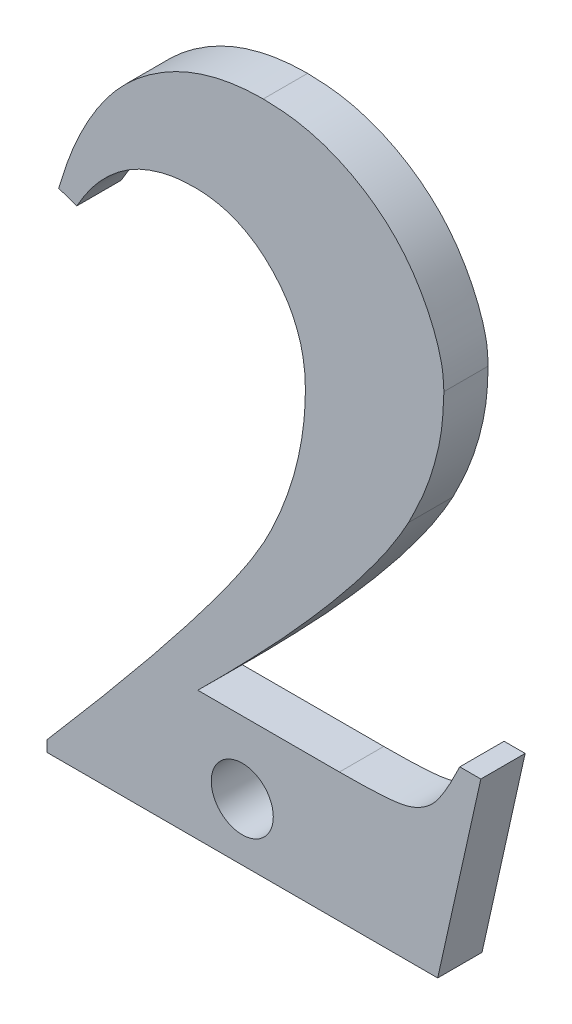
ISO-10303-21;
HEADER;
FILE_DESCRIPTION(('STEP AP214'),'2;1');
FILE_NAME('part.step','',(''),(''),'','','');
FILE_SCHEMA(('AUTOMOTIVE_DESIGN { 1 0 10303 214 1 1 1 1 }'));
ENDSEC;
DATA;
#1=APPLICATION_CONTEXT('core data for automotive mechanical design processes');
#2=APPLICATION_PROTOCOL_DEFINITION('international standard','automotive_design',2000,#1);
#3=PRODUCT_CONTEXT('',#1,'mechanical');
#4=PRODUCT('Part','Part','',(#3));
#5=PRODUCT_RELATED_PRODUCT_CATEGORY('part','',(#4));
#6=PRODUCT_DEFINITION_FORMATION('','',#4);
#7=PRODUCT_DEFINITION_CONTEXT('part definition',#1,'design');
#8=PRODUCT_DEFINITION('design','',#6,#7);
#9=PRODUCT_DEFINITION_SHAPE('','',#8);
#10=(LENGTH_UNIT() NAMED_UNIT(*) SI_UNIT(.MILLI.,.METRE.));
#11=(NAMED_UNIT(*) PLANE_ANGLE_UNIT() SI_UNIT($,.RADIAN.));
#12=(NAMED_UNIT(*) SI_UNIT($,.STERADIAN.) SOLID_ANGLE_UNIT());
#13=UNCERTAINTY_MEASURE_WITH_UNIT(LENGTH_MEASURE(1.E-05),#10,'distance_accuracy_value','');
#14=(GEOMETRIC_REPRESENTATION_CONTEXT(3) GLOBAL_UNCERTAINTY_ASSIGNED_CONTEXT((#13)) GLOBAL_UNIT_ASSIGNED_CONTEXT((#10,
#11,#12)) REPRESENTATION_CONTEXT('',''));
#15=CARTESIAN_POINT('',(0.,0.,0.));
#16=DIRECTION('',(0.,0.,1.));
#17=DIRECTION('',(1.,0.,0.));
#18=AXIS2_PLACEMENT_3D('',#15,#16,#17);
#19=CARTESIAN_POINT('',(32.1256973052124,19.955600964685,2.));
#20=DIRECTION('',(0.976135765287796,-0.217161156116854,0.));
#21=DIRECTION('',(0.217161156116854,0.976135765287796,0.));
#22=AXIS2_PLACEMENT_3D('',#19,#20,#21);
#23=PLANE('',#22);
#24=DIRECTION('',(-0.217161156116854,-0.976135765287796,0.));
#25=VECTOR('',#24,1.);
#26=CARTESIAN_POINT('',(32.1256973052124,19.955600964685,0.));
#27=LINE('',#26,#25);
#28=CARTESIAN_POINT('',(32.1256973052124,19.955600964685,0.));
#29=VERTEX_POINT('',#28);
#30=CARTESIAN_POINT('',(30.1790827218791,11.205600964685,0.));
#31=VERTEX_POINT('',#30);
#32=EDGE_CURVE('E288',#29,#31,#27,.T.);
#33=ORIENTED_EDGE('',*,*,#32,.F.);
#34=DIRECTION('',(0.,0.,-1.));
#35=VECTOR('',#34,1.);
#36=CARTESIAN_POINT('',(32.1256973052124,19.955600964685,2.));
#37=LINE('',#36,#35);
#38=CARTESIAN_POINT('',(32.1256973052124,19.955600964685,2.));
#39=VERTEX_POINT('',#38);
#40=EDGE_CURVE('E11',#39,#29,#37,.T.);
#41=ORIENTED_EDGE('',*,*,#40,.F.);
#42=DIRECTION('',(-0.217161156116854,-0.976135765287796,0.));
#43=VECTOR('',#42,1.);
#44=CARTESIAN_POINT('',(32.1256973052124,19.955600964685,2.));
#45=LINE('',#44,#43);
#46=CARTESIAN_POINT('',(30.1790827218791,11.205600964685,2.));
#47=VERTEX_POINT('',#46);
#48=EDGE_CURVE('E295',#39,#47,#45,.T.);
#49=ORIENTED_EDGE('',*,*,#48,.T.);
#50=DIRECTION('',(0.,0.,-1.));
#51=VECTOR('',#50,1.);
#52=CARTESIAN_POINT('',(30.1790827218791,11.205600964685,2.));
#53=LINE('',#52,#51);
#54=EDGE_CURVE('E40',#47,#31,#53,.T.);
#55=ORIENTED_EDGE('',*,*,#54,.T.);
#56=EDGE_LOOP('',(#33,#41,#49,#55));
#57=FACE_BOUND('',#56,.T.);
#58=ADVANCED_FACE('F37',(#57),#23,.T.);
#59=CARTESIAN_POINT('',(31.1751764718791,19.955600964685,2.));
#60=DIRECTION('',(0.,1.,0.));
#61=DIRECTION('',(0.,0.,1.));
#62=AXIS2_PLACEMENT_3D('',#59,#60,#61);
#63=PLANE('',#62);
#64=DIRECTION('',(1.,0.,0.));
#65=VECTOR('',#64,1.);
#66=CARTESIAN_POINT('',(31.1751764718791,19.955600964685,0.));
#67=LINE('',#66,#65);
#68=CARTESIAN_POINT('',(31.1751764718791,19.955600964685,0.));
#69=VERTEX_POINT('',#68);
#70=EDGE_CURVE('E294',#69,#29,#67,.T.);
#71=ORIENTED_EDGE('',*,*,#70,.F.);
#72=DIRECTION('',(0.,0.,-1.));
#73=VECTOR('',#72,1.);
#74=CARTESIAN_POINT('',(31.1751764718791,19.955600964685,2.));
#75=LINE('',#74,#73);
#76=CARTESIAN_POINT('',(31.1751764718791,19.955600964685,2.));
#77=VERTEX_POINT('',#76);
#78=EDGE_CURVE('E46',#77,#69,#75,.T.);
#79=ORIENTED_EDGE('',*,*,#78,.F.);
#80=DIRECTION('',(1.,0.,0.));
#81=VECTOR('',#80,1.);
#82=CARTESIAN_POINT('',(31.1751764718791,19.955600964685,2.));
#83=LINE('',#82,#81);
#84=EDGE_CURVE('E160',#77,#39,#83,.T.);
#85=ORIENTED_EDGE('',*,*,#84,.T.);
#86=ORIENTED_EDGE('',*,*,#40,.T.);
#87=EDGE_LOOP('',(#71,#79,#85,#86));
#88=FACE_BOUND('',#87,.T.);
#89=ADVANCED_FACE('F183',(#88),#63,.T.);
#90=CARTESIAN_POINT('',(25.7454889718791,17.0389342980183,2.));
#91=CARTESIAN_POINT('',(25.9343136454098,17.0374642110336,2.));
#92=CARTESIAN_POINT('',(26.292485047655,17.0346756818288,2.));
#93=CARTESIAN_POINT('',(26.804467081618,17.0533849821531,2.));
#94=CARTESIAN_POINT('',(27.2650009298902,17.0598931247864,2.));
#95=CARTESIAN_POINT('',(27.6726909838592,17.0899066015692,2.));
#96=CARTESIAN_POINT('',(28.0287995636569,17.1145824506281,2.));
#97=CARTESIAN_POINT('',(28.3338956544454,17.1427808252753,2.));
#98=CARTESIAN_POINT('',(28.5870447080286,17.1909813001313,2.));
#99=CARTESIAN_POINT('',(28.9670403916918,17.2719448112459,2.));
#100=CARTESIAN_POINT('',(29.4533257375363,17.4838455965586,2.));
#101=CARTESIAN_POINT('',(29.9244831407864,17.8446529890732,2.));
#102=CARTESIAN_POINT('',(30.2502710835867,18.2626609520851,2.));
#103=CARTESIAN_POINT('',(30.5314567461514,18.7068770562229,2.));
#104=CARTESIAN_POINT('',(30.8505597612063,19.2832156923998,2.));
#105=CARTESIAN_POINT('',(31.0603904840978,19.7178423863022,2.));
#106=CARTESIAN_POINT('',(31.1751764718791,19.955600964685,2.));
#107=B_SPLINE_CURVE_WITH_KNOTS('',3,(#90,#91,#92,#93,#94,#95,#96,#97,#98,#99,#100,#101,#102,
#103,#104,#105,#106),.UNSPECIFIED.,.F.,.F.,(4,1,1,1,1,1,1,1,1,1,1,1,1,1,4),(0.,
0.083240389419095,0.157894233016192,0.225852991447185,0.286251889265968,0.338059890050173,
0.383282584523152,0.421193535347129,0.451600672816963,0.554494108584796,0.651921996517284,
0.709750198168507,0.787243964763932,0.88361374671698,1.),.UNSPECIFIED.);
#108=DIRECTION('',(0.,0.,-1.));
#109=VECTOR('',#108,1.);
#110=SURFACE_OF_LINEAR_EXTRUSION('',#107,#109);
#111=CARTESIAN_POINT('',(25.7454889718791,17.0389342980183,0.));
#112=CARTESIAN_POINT('',(25.9343136454098,17.0374642110336,0.));
#113=CARTESIAN_POINT('',(26.292485047655,17.0346756818288,0.));
#114=CARTESIAN_POINT('',(26.804467081618,17.0533849821531,0.));
#115=CARTESIAN_POINT('',(27.2650009298902,17.0598931247864,0.));
#116=CARTESIAN_POINT('',(27.6726909838592,17.0899066015692,0.));
#117=CARTESIAN_POINT('',(28.0287995636569,17.1145824506281,0.));
#118=CARTESIAN_POINT('',(28.3338956544454,17.1427808252753,0.));
#119=CARTESIAN_POINT('',(28.5870447080286,17.1909813001313,0.));
#120=CARTESIAN_POINT('',(28.9670403916918,17.2719448112459,0.));
#121=CARTESIAN_POINT('',(29.4533257375363,17.4838455965586,0.));
#122=CARTESIAN_POINT('',(29.9244831407864,17.8446529890732,0.));
#123=CARTESIAN_POINT('',(30.2502710835867,18.2626609520851,0.));
#124=CARTESIAN_POINT('',(30.5314567461514,18.7068770562229,0.));
#125=CARTESIAN_POINT('',(30.8505597612063,19.2832156923998,0.));
#126=CARTESIAN_POINT('',(31.0603904840978,19.7178423863022,0.));
#127=CARTESIAN_POINT('',(31.1751764718791,19.955600964685,0.));
#128=B_SPLINE_CURVE_WITH_KNOTS('',3,(#111,#112,#113,#114,#115,#116,#117,#118,#119,#120,#121,
#122,#123,#124,#125,#126,#127),.UNSPECIFIED.,.F.,.F.,(4,1,1,1,1,1,1,1,1,1,1,1,1,1,4),(0.,
0.083240389419095,0.157894233016192,0.225852991447185,0.286251889265968,0.338059890050173,
0.383282584523152,0.421193535347129,0.451600672816963,0.554494108584796,0.651921996517284,
0.709750198168507,0.787243964763932,0.88361374671698,1.),.UNSPECIFIED.);
#129=CARTESIAN_POINT('',(25.7454889718791,17.0389342980183,0.));
#130=VERTEX_POINT('',#129);
#131=EDGE_CURVE('E147',#130,#69,#128,.T.);
#132=ORIENTED_EDGE('',*,*,#131,.F.);
#133=DIRECTION('',(0.,0.,-1.));
#134=VECTOR('',#133,1.);
#135=CARTESIAN_POINT('',(25.7454889718791,17.0389342980183,2.));
#136=LINE('',#135,#134);
#137=CARTESIAN_POINT('',(25.7454889718791,17.0389342980183,2.));
#138=VERTEX_POINT('',#137);
#139=EDGE_CURVE('E142',#138,#130,#136,.T.);
#140=ORIENTED_EDGE('',*,*,#139,.F.);
#141=EDGE_CURVE('E145',#138,#77,#107,.T.);
#142=ORIENTED_EDGE('',*,*,#141,.T.);
#143=ORIENTED_EDGE('',*,*,#78,.T.);
#144=EDGE_LOOP('',(#132,#140,#142,#143));
#145=FACE_BOUND('',#144,.T.);
#146=ADVANCED_FACE('F144',(#145),#110,.T.);
#147=CARTESIAN_POINT('',(19.3522598052124,17.0389342980183,2.));
#148=DIRECTION('',(0.,1.,0.));
#149=DIRECTION('',(0.,0.,1.));
#150=AXIS2_PLACEMENT_3D('',#147,#148,#149);
#151=PLANE('',#150);
#152=DIRECTION('',(1.,0.,0.));
#153=VECTOR('',#152,1.);
#154=CARTESIAN_POINT('',(19.3522598052124,17.0389342980183,0.));
#155=LINE('',#154,#153);
#156=CARTESIAN_POINT('',(19.3522598052124,17.0389342980183,0.));
#157=VERTEX_POINT('',#156);
#158=EDGE_CURVE('E299',#157,#130,#155,.T.);
#159=ORIENTED_EDGE('',*,*,#158,.F.);
#160=DIRECTION('',(0.,0.,-1.));
#161=VECTOR('',#160,1.);
#162=CARTESIAN_POINT('',(19.3522598052124,17.0389342980183,2.));
#163=LINE('',#162,#161);
#164=CARTESIAN_POINT('',(19.3522598052124,17.0389342980183,2.));
#165=VERTEX_POINT('',#164);
#166=EDGE_CURVE('E152',#165,#157,#163,.T.);
#167=ORIENTED_EDGE('',*,*,#166,.F.);
#168=DIRECTION('',(1.,0.,0.));
#169=VECTOR('',#168,1.);
#170=CARTESIAN_POINT('',(19.3522598052124,17.0389342980183,2.));
#171=LINE('',#170,#169);
#172=EDGE_CURVE('E158',#165,#138,#171,.T.);
#173=ORIENTED_EDGE('',*,*,#172,.T.);
#174=ORIENTED_EDGE('',*,*,#139,.T.);
#175=EDGE_LOOP('',(#159,#167,#173,#174));
#176=FACE_BOUND('',#175,.T.);
#177=ADVANCED_FACE('F162',(#176),#151,.T.);
#178=CARTESIAN_POINT('',(28.8639785552124,28.3475280480183,2.));
#179=CARTESIAN_POINT('',(28.7678698204898,28.1730106608677,2.));
#180=CARTESIAN_POINT('',(28.5697585399411,27.8132737113989,2.));
#181=CARTESIAN_POINT('',(28.2312061797918,27.2721430185477,2.));
#182=CARTESIAN_POINT('',(27.8650115876253,26.6986171897699,2.));
#183=CARTESIAN_POINT('',(27.4445100977633,26.1076610030207,2.));
#184=CARTESIAN_POINT('',(26.9879284562891,25.4913841157876,2.));
#185=CARTESIAN_POINT('',(26.5012865369827,24.8403102449559,2.));
#186=CARTESIAN_POINT('',(25.957900082726,24.177108889088,2.));
#187=CARTESIAN_POINT('',(25.3884707024371,23.4779288731548,2.));
#188=CARTESIAN_POINT('',(24.771397810861,22.7597122770582,2.));
#189=CARTESIAN_POINT('',(24.1176254870682,22.0157886355262,2.));
#190=CARTESIAN_POINT('',(23.4252783189491,21.2433702083537,2.));
#191=CARTESIAN_POINT('',(22.6890521565421,20.4494382026917,2.));
#192=CARTESIAN_POINT('',(21.9102266603001,19.6330101422384,2.));
#193=CARTESIAN_POINT('',(21.0916220486043,18.7913686622301,2.));
#194=CARTESIAN_POINT('',(20.2432574657832,17.916656161679,2.));
#195=CARTESIAN_POINT('',(19.6528975701409,17.3350925832721,2.));
#196=CARTESIAN_POINT('',(19.3522598052124,17.0389342980183,2.));
#197=B_SPLINE_CURVE_WITH_KNOTS('',3,(#178,#179,#180,#181,#182,#183,#184,#185,#186,#187,#188,
#189,#190,#191,#192,#193,#194,#195,#196),.UNSPECIFIED.,.F.,.F.,(4,1,1,1,1,1,1,1,1,1,1,1,1,1,1,1,
4),(0.,0.0403203025373612,0.0831132236923392,0.129170361056879,0.178040831849241,
0.229877422438608,0.2844363080207,0.342543920752736,0.403400881429447,0.466961143930751,
0.534194980914522,0.603872735331149,0.676921008552932,0.753355270369661,0.832261518178811,
0.914580033909062,1.),.UNSPECIFIED.);
#198=DIRECTION('',(0.,0.,-1.));
#199=VECTOR('',#198,1.);
#200=SURFACE_OF_LINEAR_EXTRUSION('',#197,#199);
#201=CARTESIAN_POINT('',(28.8639785552124,28.3475280480183,0.));
#202=CARTESIAN_POINT('',(28.7678698204898,28.1730106608677,0.));
#203=CARTESIAN_POINT('',(28.5697585399411,27.8132737113989,0.));
#204=CARTESIAN_POINT('',(28.2312061797918,27.2721430185477,0.));
#205=CARTESIAN_POINT('',(27.8650115876253,26.6986171897699,0.));
#206=CARTESIAN_POINT('',(27.4445100977633,26.1076610030207,0.));
#207=CARTESIAN_POINT('',(26.9879284562891,25.4913841157876,0.));
#208=CARTESIAN_POINT('',(26.5012865369827,24.8403102449559,0.));
#209=CARTESIAN_POINT('',(25.957900082726,24.177108889088,0.));
#210=CARTESIAN_POINT('',(25.3884707024371,23.4779288731548,0.));
#211=CARTESIAN_POINT('',(24.771397810861,22.7597122770582,0.));
#212=CARTESIAN_POINT('',(24.1176254870682,22.0157886355262,0.));
#213=CARTESIAN_POINT('',(23.4252783189491,21.2433702083537,0.));
#214=CARTESIAN_POINT('',(22.6890521565421,20.4494382026917,0.));
#215=CARTESIAN_POINT('',(21.9102266603001,19.6330101422384,0.));
#216=CARTESIAN_POINT('',(21.0916220486043,18.7913686622301,0.));
#217=CARTESIAN_POINT('',(20.2432574657832,17.916656161679,0.));
#218=CARTESIAN_POINT('',(19.6528975701409,17.3350925832721,0.));
#219=CARTESIAN_POINT('',(19.3522598052124,17.0389342980183,0.));
#220=B_SPLINE_CURVE_WITH_KNOTS('',3,(#201,#202,#203,#204,#205,#206,#207,#208,#209,#210,#211,
#212,#213,#214,#215,#216,#217,#218,#219),.UNSPECIFIED.,.F.,.F.,(4,1,1,1,1,1,1,1,1,1,1,1,1,1,1,1,
4),(0.,0.0403203025373612,0.0831132236923392,0.129170361056879,0.178040831849241,
0.229877422438608,0.2844363080207,0.342543920752736,0.403400881429447,0.466961143930751,
0.534194980914522,0.603872735331149,0.676921008552932,0.753355270369661,0.832261518178811,
0.914580033909062,1.),.UNSPECIFIED.);
#221=CARTESIAN_POINT('',(28.8639785552124,28.3475280480183,0.));
#222=VERTEX_POINT('',#221);
#223=EDGE_CURVE('E380',#222,#157,#220,.T.);
#224=ORIENTED_EDGE('',*,*,#223,.F.);
#225=DIRECTION('',(0.,0.,-1.));
#226=VECTOR('',#225,1.);
#227=CARTESIAN_POINT('',(28.8639785552124,28.3475280480183,2.));
#228=LINE('',#227,#226);
#229=CARTESIAN_POINT('',(28.8639785552124,28.3475280480183,2.));
#230=VERTEX_POINT('',#229);
#231=EDGE_CURVE('E307',#230,#222,#228,.T.);
#232=ORIENTED_EDGE('',*,*,#231,.F.);
#233=EDGE_CURVE('E163',#230,#165,#197,.T.);
#234=ORIENTED_EDGE('',*,*,#233,.T.);
#235=ORIENTED_EDGE('',*,*,#166,.T.);
#236=EDGE_LOOP('',(#224,#232,#234,#235));
#237=FACE_BOUND('',#236,.T.);
#238=ADVANCED_FACE('F187',(#237),#200,.T.);
#239=CARTESIAN_POINT('',(30.4590306385457,34.2589863813516,2.));
#240=CARTESIAN_POINT('',(30.4403306453467,33.7713349993683,2.));
#241=CARTESIAN_POINT('',(30.4024198706715,32.7827120910262,2.));
#242=CARTESIAN_POINT('',(30.0833594108594,31.3003918786145,2.));
#243=CARTESIAN_POINT('',(29.5835499330912,29.804525810209,2.));
#244=CARTESIAN_POINT('',(29.1080107227115,28.8416476487685,2.));
#245=CARTESIAN_POINT('',(28.8639785552124,28.3475280480183,2.));
#246=B_SPLINE_CURVE_WITH_KNOTS('',3,(#239,#240,#241,#242,#243,#244,#245),.UNSPECIFIED.,.F.,.F.,
(4,1,1,1,4),(0.,0.236452493409344,0.479363660917661,0.732825366380148,1.),.UNSPECIFIED.);
#247=DIRECTION('',(0.,0.,-1.));
#248=VECTOR('',#247,1.);
#249=SURFACE_OF_LINEAR_EXTRUSION('',#246,#248);
#250=CARTESIAN_POINT('',(30.4590306385457,34.2589863813516,0.));
#251=CARTESIAN_POINT('',(30.4403306453467,33.7713349993683,0.));
#252=CARTESIAN_POINT('',(30.4024198706715,32.7827120910262,0.));
#253=CARTESIAN_POINT('',(30.0833594108594,31.3003918786145,0.));
#254=CARTESIAN_POINT('',(29.5835499330912,29.804525810209,0.));
#255=CARTESIAN_POINT('',(29.1080107227115,28.8416476487685,0.));
#256=CARTESIAN_POINT('',(28.8639785552124,28.3475280480183,0.));
#257=B_SPLINE_CURVE_WITH_KNOTS('',3,(#250,#251,#252,#253,#254,#255,#256),.UNSPECIFIED.,.F.,.F.,
(4,1,1,1,4),(0.,0.236452493409344,0.479363660917661,0.732825366380148,1.),.UNSPECIFIED.);
#258=CARTESIAN_POINT('',(30.4590306385457,34.2589863813516,0.));
#259=VERTEX_POINT('',#258);
#260=EDGE_CURVE('E372',#259,#222,#257,.T.);
#261=ORIENTED_EDGE('',*,*,#260,.F.);
#262=DIRECTION('',(0.,0.,-1.));
#263=VECTOR('',#262,1.);
#264=CARTESIAN_POINT('',(30.4590306385457,34.2589863813516,2.));
#265=LINE('',#264,#263);
#266=CARTESIAN_POINT('',(30.4590306385457,34.2589863813516,2.));
#267=VERTEX_POINT('',#266);
#268=EDGE_CURVE('E309',#267,#259,#265,.T.);
#269=ORIENTED_EDGE('',*,*,#268,.F.);
#270=EDGE_CURVE('E165',#267,#230,#246,.T.);
#271=ORIENTED_EDGE('',*,*,#270,.T.);
#272=ORIENTED_EDGE('',*,*,#231,.T.);
#273=EDGE_LOOP('',(#261,#269,#271,#272));
#274=FACE_BOUND('',#273,.T.);
#275=ADVANCED_FACE('F190',(#274),#249,.T.);
#276=CARTESIAN_POINT('',(22.3079889718791,41.6222676313516,2.));
#277=CARTESIAN_POINT('',(22.6798969814778,41.6099157382477,2.));
#278=CARTESIAN_POINT('',(23.4137888682885,41.5855415545739,2.));
#279=CARTESIAN_POINT('',(24.4878602890589,41.3874551304656,2.));
#280=CARTESIAN_POINT('',(25.5086153988089,41.0502792132315,2.));
#281=CARTESIAN_POINT('',(26.4684078492238,40.5892628852204,2.));
#282=CARTESIAN_POINT('',(27.3551637038943,40.0169330824227,2.));
#283=CARTESIAN_POINT('',(28.1500582943221,39.3428264795699,2.));
#284=CARTESIAN_POINT('',(28.8410289249538,38.5673555235849,2.));
#285=CARTESIAN_POINT('',(29.4083529145305,37.708211361452,2.));
#286=CARTESIAN_POINT('',(29.8660755301982,36.8221806099099,2.));
#287=CARTESIAN_POINT('',(30.2021073090276,35.9452682211718,2.));
#288=CARTESIAN_POINT('',(30.4196935184437,35.0942036598366,2.));
#289=CARTESIAN_POINT('',(30.4461995041418,34.5314207926388,2.));
#290=CARTESIAN_POINT('',(30.4590306385457,34.2589863813516,2.));
#291=B_SPLINE_CURVE_WITH_KNOTS('',3,(#276,#277,#278,#279,#280,#281,#282,#283,#284,#285,#286,
#287,#288,#289,#290),.UNSPECIFIED.,.F.,.F.,(4,1,1,1,1,1,1,1,1,1,1,1,4),(0.,0.0920022112224952,
0.181549401040564,0.269191702533681,0.357357452025037,0.444362154286541,0.529709791213243,
0.614547197274935,0.700501099701155,0.783856575557866,0.86086543261161,0.932647125267175,1.),.UNSPECIFIED.);
#292=DIRECTION('',(0.,0.,-1.));
#293=VECTOR('',#292,1.);
#294=SURFACE_OF_LINEAR_EXTRUSION('',#291,#293);
#295=CARTESIAN_POINT('',(22.3079889718791,41.6222676313516,0.));
#296=CARTESIAN_POINT('',(22.6798969814778,41.6099157382477,0.));
#297=CARTESIAN_POINT('',(23.4137888682885,41.5855415545739,0.));
#298=CARTESIAN_POINT('',(24.4878602890589,41.3874551304656,0.));
#299=CARTESIAN_POINT('',(25.5086153988089,41.0502792132315,0.));
#300=CARTESIAN_POINT('',(26.4684078492238,40.5892628852204,0.));
#301=CARTESIAN_POINT('',(27.3551637038943,40.0169330824227,0.));
#302=CARTESIAN_POINT('',(28.1500582943221,39.3428264795699,0.));
#303=CARTESIAN_POINT('',(28.8410289249538,38.5673555235849,0.));
#304=CARTESIAN_POINT('',(29.4083529145305,37.708211361452,0.));
#305=CARTESIAN_POINT('',(29.8660755301982,36.8221806099099,0.));
#306=CARTESIAN_POINT('',(30.2021073090276,35.9452682211718,0.));
#307=CARTESIAN_POINT('',(30.4196935184437,35.0942036598366,0.));
#308=CARTESIAN_POINT('',(30.4461995041418,34.5314207926388,0.));
#309=CARTESIAN_POINT('',(30.4590306385457,34.2589863813516,0.));
#310=B_SPLINE_CURVE_WITH_KNOTS('',3,(#295,#296,#297,#298,#299,#300,#301,#302,#303,#304,#305,
#306,#307,#308,#309),.UNSPECIFIED.,.F.,.F.,(4,1,1,1,1,1,1,1,1,1,1,1,4),(0.,0.0920022112224952,
0.181549401040564,0.269191702533681,0.357357452025037,0.444362154286541,0.529709791213243,
0.614547197274935,0.700501099701155,0.783856575557866,0.86086543261161,0.932647125267175,1.),.UNSPECIFIED.);
#311=CARTESIAN_POINT('',(22.3079889718791,41.6222676313516,0.));
#312=VERTEX_POINT('',#311);
#313=EDGE_CURVE('E364',#312,#259,#310,.T.);
#314=ORIENTED_EDGE('',*,*,#313,.F.);
#315=DIRECTION('',(0.,0.,-1.));
#316=VECTOR('',#315,1.);
#317=CARTESIAN_POINT('',(22.3079889718791,41.6222676313516,2.));
#318=LINE('',#317,#316);
#319=CARTESIAN_POINT('',(22.3079889718791,41.6222676313516,2.));
#320=VERTEX_POINT('',#319);
#321=EDGE_CURVE('E311',#320,#312,#318,.T.);
#322=ORIENTED_EDGE('',*,*,#321,.F.);
#323=EDGE_CURVE('E202',#320,#267,#291,.T.);
#324=ORIENTED_EDGE('',*,*,#323,.T.);
#325=ORIENTED_EDGE('',*,*,#268,.T.);
#326=EDGE_LOOP('',(#314,#322,#324,#325));
#327=FACE_BOUND('',#326,.T.);
#328=ADVANCED_FACE('F194',(#327),#294,.T.);
#329=CARTESIAN_POINT('',(13.0762181385457,33.5167988813516,2.));
#330=CARTESIAN_POINT('',(13.1790540613258,33.8521464435644,2.));
#331=CARTESIAN_POINT('',(13.3791571132156,34.5046817525161,2.));
#332=CARTESIAN_POINT('',(13.7306390844949,35.4417677591126,2.));
#333=CARTESIAN_POINT('',(14.1284970830099,36.3088083732722,2.));
#334=CARTESIAN_POINT('',(14.5632825813145,37.1095471703075,2.));
#335=CARTESIAN_POINT('',(15.0336005957726,37.8442581427966,2.));
#336=CARTESIAN_POINT('',(15.5420578003297,38.5136134936473,2.));
#337=CARTESIAN_POINT('',(16.0951268290853,39.1114980040282,2.));
#338=CARTESIAN_POINT('',(16.6840715027981,39.6426884821639,2.));
#339=CARTESIAN_POINT('',(17.3056180918504,40.1049900452009,2.));
#340=CARTESIAN_POINT('',(17.9518974271744,40.5106432200958,2.));
#341=CARTESIAN_POINT('',(18.6220142375797,40.8564404302142,2.));
#342=CARTESIAN_POINT('',(19.3148001956653,41.1381917202417,2.));
#343=CARTESIAN_POINT('',(20.0303018195383,41.3529405199028,2.));
#344=CARTESIAN_POINT('',(20.7679794532014,41.5108813592801,2.));
#345=CARTESIAN_POINT('',(21.5309612480016,41.6020612842218,2.));
#346=CARTESIAN_POINT('',(22.0473379738457,41.6154894889712,2.));
#347=CARTESIAN_POINT('',(22.3079889718791,41.6222676313516,2.));
#348=B_SPLINE_CURVE_WITH_KNOTS('',3,(#329,#330,#331,#332,#333,#334,#335,#336,#337,#338,#339,
#340,#341,#342,#343,#344,#345,#346,#347),.UNSPECIFIED.,.F.,.F.,(4,1,1,1,1,1,1,1,1,1,1,1,1,1,1,1,
4),(0.,0.0791525339711541,0.154018782389168,0.225684509569703,0.29428552487802,
0.359498355238727,0.422389162261132,0.483737218891553,0.543041353813505,0.601129629489874,
0.65834200076558,0.71507647990047,0.771102534708094,0.826881848391228,0.883461786408939,
0.941175114676421,1.),.UNSPECIFIED.);
#349=DIRECTION('',(0.,0.,-1.));
#350=VECTOR('',#349,1.);
#351=SURFACE_OF_LINEAR_EXTRUSION('',#348,#350);
#352=CARTESIAN_POINT('',(13.0762181385457,33.5167988813516,0.));
#353=CARTESIAN_POINT('',(13.1790540613258,33.8521464435644,0.));
#354=CARTESIAN_POINT('',(13.3791571132156,34.5046817525161,0.));
#355=CARTESIAN_POINT('',(13.7306390844949,35.4417677591126,0.));
#356=CARTESIAN_POINT('',(14.1284970830099,36.3088083732722,0.));
#357=CARTESIAN_POINT('',(14.5632825813145,37.1095471703075,0.));
#358=CARTESIAN_POINT('',(15.0336005957726,37.8442581427966,0.));
#359=CARTESIAN_POINT('',(15.5420578003297,38.5136134936473,0.));
#360=CARTESIAN_POINT('',(16.0951268290853,39.1114980040282,0.));
#361=CARTESIAN_POINT('',(16.6840715027981,39.6426884821639,0.));
#362=CARTESIAN_POINT('',(17.3056180918504,40.1049900452009,0.));
#363=CARTESIAN_POINT('',(17.9518974271744,40.5106432200958,0.));
#364=CARTESIAN_POINT('',(18.6220142375797,40.8564404302142,0.));
#365=CARTESIAN_POINT('',(19.3148001956653,41.1381917202417,0.));
#366=CARTESIAN_POINT('',(20.0303018195383,41.3529405199028,0.));
#367=CARTESIAN_POINT('',(20.7679794532014,41.5108813592801,0.));
#368=CARTESIAN_POINT('',(21.5309612480016,41.6020612842218,0.));
#369=CARTESIAN_POINT('',(22.0473379738457,41.6154894889712,0.));
#370=CARTESIAN_POINT('',(22.3079889718791,41.6222676313516,0.));
#371=B_SPLINE_CURVE_WITH_KNOTS('',3,(#352,#353,#354,#355,#356,#357,#358,#359,#360,#361,#362,
#363,#364,#365,#366,#367,#368,#369,#370),.UNSPECIFIED.,.F.,.F.,(4,1,1,1,1,1,1,1,1,1,1,1,1,1,1,1,
4),(0.,0.0791525339711541,0.154018782389168,0.225684509569703,0.29428552487802,
0.359498355238727,0.422389162261132,0.483737218891553,0.543041353813505,0.601129629489874,
0.65834200076558,0.71507647990047,0.771102534708094,0.826881848391228,0.883461786408939,
0.941175114676421,1.),.UNSPECIFIED.);
#372=CARTESIAN_POINT('',(13.0762181385457,33.5167988813516,0.));
#373=VERTEX_POINT('',#372);
#374=EDGE_CURVE('E359',#373,#312,#371,.T.);
#375=ORIENTED_EDGE('',*,*,#374,.F.);
#376=DIRECTION('',(0.,0.,-1.));
#377=VECTOR('',#376,1.);
#378=CARTESIAN_POINT('',(13.0762181385457,33.5167988813516,2.));
#379=LINE('',#378,#377);
#380=CARTESIAN_POINT('',(13.0762181385457,33.5167988813516,2.));
#381=VERTEX_POINT('',#380);
#382=EDGE_CURVE('E313',#381,#373,#379,.T.);
#383=ORIENTED_EDGE('',*,*,#382,.F.);
#384=EDGE_CURVE('E211',#381,#320,#348,.T.);
#385=ORIENTED_EDGE('',*,*,#384,.T.);
#386=ORIENTED_EDGE('',*,*,#321,.T.);
#387=EDGE_LOOP('',(#375,#383,#385,#386));
#388=FACE_BOUND('',#387,.T.);
#389=ADVANCED_FACE('F225',(#388),#351,.T.);
#390=CARTESIAN_POINT('',(13.8900202218791,33.2303405480183,2.));
#391=DIRECTION('',(-0.332030557821672,-0.943268630175217,0.));
#392=DIRECTION('',(0.943268630175217,-0.332030557821672,0.));
#393=AXIS2_PLACEMENT_3D('',#390,#391,#392);
#394=PLANE('',#393);
#395=DIRECTION('',(-0.943268630175217,0.332030557821672,0.));
#396=VECTOR('',#395,1.);
#397=CARTESIAN_POINT('',(13.8900202218791,33.2303405480183,0.));
#398=LINE('',#397,#396);
#399=CARTESIAN_POINT('',(13.8900202218791,33.2303405480183,0.));
#400=VERTEX_POINT('',#399);
#401=EDGE_CURVE('E353',#400,#373,#398,.T.);
#402=ORIENTED_EDGE('',*,*,#401,.F.);
#403=DIRECTION('',(0.,0.,-1.));
#404=VECTOR('',#403,1.);
#405=CARTESIAN_POINT('',(13.8900202218791,33.2303405480183,2.));
#406=LINE('',#405,#404);
#407=CARTESIAN_POINT('',(13.8900202218791,33.2303405480183,2.));
#408=VERTEX_POINT('',#407);
#409=EDGE_CURVE('E315',#408,#400,#406,.T.);
#410=ORIENTED_EDGE('',*,*,#409,.F.);
#411=DIRECTION('',(-0.943268630175217,0.332030557821672,0.));
#412=VECTOR('',#411,1.);
#413=CARTESIAN_POINT('',(13.8900202218791,33.2303405480183,2.));
#414=LINE('',#413,#412);
#415=EDGE_CURVE('E220',#408,#381,#414,.T.);
#416=ORIENTED_EDGE('',*,*,#415,.T.);
#417=ORIENTED_EDGE('',*,*,#382,.T.);
#418=EDGE_LOOP('',(#402,#410,#416,#417));
#419=FACE_BOUND('',#418,.T.);
#420=ADVANCED_FACE('F228',(#419),#394,.T.);
#421=CARTESIAN_POINT('',(19.2155410552124,36.6222676313516,2.));
#422=CARTESIAN_POINT('',(18.9368449934725,36.6134457603645,2.));
#423=CARTESIAN_POINT('',(18.3896534930608,36.5961249098588,2.));
#424=CARTESIAN_POINT('',(17.5976493588656,36.4247922388427,2.));
#425=CARTESIAN_POINT('',(16.8494447877129,36.1662039076308,2.));
#426=CARTESIAN_POINT('',(16.1518297508017,35.7887320988414,2.));
#427=CARTESIAN_POINT('',(15.5063399659201,35.3023590656052,2.));
#428=CARTESIAN_POINT('',(14.9071442880507,34.7137388842915,2.));
#429=CARTESIAN_POINT('',(14.3569455553018,34.0209641881851,2.));
#430=CARTESIAN_POINT('',(14.0487871899832,33.4991735054006,2.));
#431=CARTESIAN_POINT('',(13.8900202218791,33.2303405480183,2.));
#432=B_SPLINE_CURVE_WITH_KNOTS('',3,(#421,#422,#423,#424,#425,#426,#427,#428,#429,#430,#431),
.UNSPECIFIED.,.F.,.F.,(4,1,1,1,1,1,1,1,4),(0.,0.125501174021831,0.246408848721124,
0.363710604376433,0.481484892978938,0.602436120178102,0.726995246620179,0.859344603780865,1.),.UNSPECIFIED.);
#433=DIRECTION('',(0.,0.,-1.));
#434=VECTOR('',#433,1.);
#435=SURFACE_OF_LINEAR_EXTRUSION('',#432,#434);
#436=CARTESIAN_POINT('',(19.2155410552124,36.6222676313516,0.));
#437=CARTESIAN_POINT('',(18.9368449934725,36.6134457603645,0.));
#438=CARTESIAN_POINT('',(18.3896534930608,36.5961249098588,0.));
#439=CARTESIAN_POINT('',(17.5976493588656,36.4247922388427,0.));
#440=CARTESIAN_POINT('',(16.8494447877129,36.1662039076308,0.));
#441=CARTESIAN_POINT('',(16.1518297508017,35.7887320988414,0.));
#442=CARTESIAN_POINT('',(15.5063399659201,35.3023590656052,0.));
#443=CARTESIAN_POINT('',(14.9071442880507,34.7137388842915,0.));
#444=CARTESIAN_POINT('',(14.3569455553018,34.0209641881851,0.));
#445=CARTESIAN_POINT('',(14.0487871899832,33.4991735054006,0.));
#446=CARTESIAN_POINT('',(13.8900202218791,33.2303405480183,0.));
#447=B_SPLINE_CURVE_WITH_KNOTS('',3,(#436,#437,#438,#439,#440,#441,#442,#443,#444,#445,#446),
.UNSPECIFIED.,.F.,.F.,(4,1,1,1,1,1,1,1,4),(0.,0.125501174021831,0.246408848721124,
0.363710604376433,0.481484892978938,0.602436120178102,0.726995246620179,0.859344603780865,1.),.UNSPECIFIED.);
#448=CARTESIAN_POINT('',(19.2155410552124,36.6222676313516,0.));
#449=VERTEX_POINT('',#448);
#450=EDGE_CURVE('E345',#449,#400,#447,.T.);
#451=ORIENTED_EDGE('',*,*,#450,.F.);
#452=DIRECTION('',(0.,0.,-1.));
#453=VECTOR('',#452,1.);
#454=CARTESIAN_POINT('',(19.2155410552124,36.6222676313516,2.));
#455=LINE('',#454,#453);
#456=CARTESIAN_POINT('',(19.2155410552124,36.6222676313516,2.));
#457=VERTEX_POINT('',#456);
#458=EDGE_CURVE('E317',#457,#449,#455,.T.);
#459=ORIENTED_EDGE('',*,*,#458,.F.);
#460=EDGE_CURVE('E240',#457,#408,#432,.T.);
#461=ORIENTED_EDGE('',*,*,#460,.T.);
#462=ORIENTED_EDGE('',*,*,#409,.T.);
#463=EDGE_LOOP('',(#451,#459,#461,#462));
#464=FACE_BOUND('',#463,.T.);
#465=ADVANCED_FACE('F232',(#464),#435,.T.);
#466=CARTESIAN_POINT('',(24.2090306385457,31.225132214685,2.));
#467=CARTESIAN_POINT('',(24.2066552525095,31.414235121519,2.));
#468=CARTESIAN_POINT('',(24.2019681829805,31.7873696179402,2.));
#469=CARTESIAN_POINT('',(24.1237538602686,32.3329822084845,2.));
#470=CARTESIAN_POINT('',(24.0193185720874,32.8584269192736,2.));
#471=CARTESIAN_POINT('',(23.8515869298445,33.3531054600501,2.));
#472=CARTESIAN_POINT('',(23.6514237884368,33.8257661346399,2.));
#473=CARTESIAN_POINT('',(23.4012853761293,34.2738952279918,2.));
#474=CARTESIAN_POINT('',(23.1005636354873,34.6938698319589,2.));
#475=CARTESIAN_POINT('',(22.765183813483,35.090463218549,2.));
#476=CARTESIAN_POINT('',(22.3947835224823,35.4459441826664,2.));
#477=CARTESIAN_POINT('',(22.0023133461029,35.7626836776316,2.));
#478=CARTESIAN_POINT('',(21.5872127446287,36.0284014915229,2.));
#479=CARTESIAN_POINT('',(21.15086871843,36.2468174375083,2.));
#480=CARTESIAN_POINT('',(20.6970638978162,36.4160977229317,2.));
#481=CARTESIAN_POINT('',(20.2207058119237,36.533298704147,2.));
#482=CARTESIAN_POINT('',(19.7256155174789,36.6064336149339,2.));
#483=CARTESIAN_POINT('',(19.3872366990832,36.6169377592545,2.));
#484=CARTESIAN_POINT('',(19.2155410552124,36.6222676313516,2.));
#485=B_SPLINE_CURVE_WITH_KNOTS('',3,(#466,#467,#468,#469,#470,#471,#472,#473,#474,#475,#476,
#477,#478,#479,#480,#481,#482,#483,#484),.UNSPECIFIED.,.F.,.F.,(4,1,1,1,1,1,1,1,1,1,1,1,1,1,1,1,
4),(0.,0.0690744097566923,0.13629639825043,0.201192779453989,0.264676708221589,0.32687820360692,
0.388688762160694,0.45187445597752,0.515477287166328,0.578328279535434,0.639297838921548,
0.699608080189086,0.758159687857189,0.817411449162247,0.876300810974107,0.937234215762125,1.),.UNSPECIFIED.);
#486=DIRECTION('',(0.,0.,-1.));
#487=VECTOR('',#486,1.);
#488=SURFACE_OF_LINEAR_EXTRUSION('',#485,#487);
#489=CARTESIAN_POINT('',(24.2090306385457,31.225132214685,0.));
#490=CARTESIAN_POINT('',(24.2066552525095,31.414235121519,0.));
#491=CARTESIAN_POINT('',(24.2019681829805,31.7873696179402,0.));
#492=CARTESIAN_POINT('',(24.1237538602686,32.3329822084845,0.));
#493=CARTESIAN_POINT('',(24.0193185720874,32.8584269192736,0.));
#494=CARTESIAN_POINT('',(23.8515869298445,33.3531054600501,0.));
#495=CARTESIAN_POINT('',(23.6514237884368,33.8257661346399,0.));
#496=CARTESIAN_POINT('',(23.4012853761293,34.2738952279918,0.));
#497=CARTESIAN_POINT('',(23.1005636354873,34.6938698319589,0.));
#498=CARTESIAN_POINT('',(22.765183813483,35.090463218549,0.));
#499=CARTESIAN_POINT('',(22.3947835224823,35.4459441826664,0.));
#500=CARTESIAN_POINT('',(22.0023133461029,35.7626836776316,0.));
#501=CARTESIAN_POINT('',(21.5872127446287,36.0284014915229,0.));
#502=CARTESIAN_POINT('',(21.15086871843,36.2468174375083,0.));
#503=CARTESIAN_POINT('',(20.6970638978162,36.4160977229317,0.));
#504=CARTESIAN_POINT('',(20.2207058119237,36.533298704147,0.));
#505=CARTESIAN_POINT('',(19.7256155174789,36.6064336149339,0.));
#506=CARTESIAN_POINT('',(19.3872366990832,36.6169377592545,0.));
#507=CARTESIAN_POINT('',(19.2155410552124,36.6222676313516,0.));
#508=B_SPLINE_CURVE_WITH_KNOTS('',3,(#489,#490,#491,#492,#493,#494,#495,#496,#497,#498,#499,
#500,#501,#502,#503,#504,#505,#506,#507),.UNSPECIFIED.,.F.,.F.,(4,1,1,1,1,1,1,1,1,1,1,1,1,1,1,1,
4),(0.,0.0690744097566923,0.13629639825043,0.201192779453989,0.264676708221589,0.32687820360692,
0.388688762160694,0.45187445597752,0.515477287166328,0.578328279535434,0.639297838921548,
0.699608080189086,0.758159687857189,0.817411449162247,0.876300810974107,0.937234215762125,1.),.UNSPECIFIED.);
#509=CARTESIAN_POINT('',(24.2090306385457,31.225132214685,0.));
#510=VERTEX_POINT('',#509);
#511=EDGE_CURVE('E337',#510,#449,#508,.T.);
#512=ORIENTED_EDGE('',*,*,#511,.F.);
#513=DIRECTION('',(0.,0.,-1.));
#514=VECTOR('',#513,1.);
#515=CARTESIAN_POINT('',(24.2090306385457,31.225132214685,2.));
#516=LINE('',#515,#514);
#517=CARTESIAN_POINT('',(24.2090306385457,31.225132214685,2.));
#518=VERTEX_POINT('',#517);
#519=EDGE_CURVE('E319',#518,#510,#516,.T.);
#520=ORIENTED_EDGE('',*,*,#519,.F.);
#521=EDGE_CURVE('E245',#518,#457,#485,.T.);
#522=ORIENTED_EDGE('',*,*,#521,.T.);
#523=ORIENTED_EDGE('',*,*,#458,.T.);
#524=EDGE_LOOP('',(#512,#520,#522,#523));
#525=FACE_BOUND('',#524,.T.);
#526=ADVANCED_FACE('F236',(#525),#488,.T.);
#527=CARTESIAN_POINT('',(12.5423639718791,11.693882214685,2.));
#528=CARTESIAN_POINT('',(12.8811367090299,12.0886488190869,2.));
#529=CARTESIAN_POINT('',(13.5427422660745,12.859607490096,2.));
#530=CARTESIAN_POINT('',(14.5084529042346,13.9927815884257,2.));
#531=CARTESIAN_POINT('',(15.418047610802,15.0794546529256,2.));
#532=CARTESIAN_POINT('',(16.2774395080301,16.1146061313557,2.));
#533=CARTESIAN_POINT('',(17.0872743158702,17.0978206915304,2.));
#534=CARTESIAN_POINT('',(17.8401405221683,18.0350831486035,2.));
#535=CARTESIAN_POINT('',(18.5462330889854,18.9203900247806,2.));
#536=CARTESIAN_POINT('',(19.1948036383353,19.760040209199,2.));
#537=CARTESIAN_POINT('',(19.7973048376097,20.5474048821801,2.));
#538=CARTESIAN_POINT('',(20.3391941839093,21.288974700354,2.));
#539=CARTESIAN_POINT('',(20.8419486317139,21.9735429718495,2.));
#540=CARTESIAN_POINT('',(21.2777165429995,22.6165006003091,2.));
#541=CARTESIAN_POINT('',(21.6765311368062,23.2037983055093,2.));
#542=CARTESIAN_POINT('',(22.0090716163063,23.748203677946,2.));
#543=CARTESIAN_POINT('',(22.3016061720441,24.2376368561865,2.));
#544=CARTESIAN_POINT('',(22.610004896476,24.8242189382095,2.));
#545=CARTESIAN_POINT('',(22.9356970272609,25.5240699902388,2.));
#546=CARTESIAN_POINT('',(23.2758671689817,26.3514087896546,2.));
#547=CARTESIAN_POINT('',(23.5644950954822,27.1745888641183,2.));
#548=CARTESIAN_POINT('',(23.7984937588228,27.9943044757559,2.));
#549=CARTESIAN_POINT('',(23.9820291679726,28.8093622100181,2.));
#550=CARTESIAN_POINT('',(24.1120526582515,29.6181295281365,2.));
#551=CARTESIAN_POINT('',(24.1939832146806,30.4226533549476,2.));
#552=CARTESIAN_POINT('',(24.2040218711243,30.9580147329788,2.));
#553=CARTESIAN_POINT('',(24.2090306385457,31.225132214685,2.));
#554=B_SPLINE_CURVE_WITH_KNOTS('',3,(#527,#528,#529,#530,#531,#532,#533,#534,#535,#536,#537,
#538,#539,#540,#541,#542,#543,#544,#545,#546,#547,#548,#549,#550,#551,#552,#553),.UNSPECIFIED.,
.F.,.F.,(4,1,1,1,1,1,1,1,1,1,1,1,1,1,1,1,1,1,1,1,1,1,1,1,4),(0.,0.0671915690217627,
0.131221643822968,0.19230578666461,0.250231492559041,0.305000247822046,0.356831801137749,
0.405511472809173,0.45126317251858,0.493870565145294,0.533563281415553,0.569896137425019,
0.603562010575041,0.633881710773111,0.661573873859912,0.685947581124658,0.707514734416432,
0.747140090900034,0.785607392718057,0.823017444989839,0.859749261966745,0.895655758257335,
0.930862871777471,0.965504169069655,1.),.UNSPECIFIED.);
#555=DIRECTION('',(0.,0.,-1.));
#556=VECTOR('',#555,1.);
#557=SURFACE_OF_LINEAR_EXTRUSION('',#554,#556);
#558=CARTESIAN_POINT('',(12.5423639718791,11.693882214685,0.));
#559=CARTESIAN_POINT('',(12.8811367090299,12.0886488190869,0.));
#560=CARTESIAN_POINT('',(13.5427422660745,12.859607490096,0.));
#561=CARTESIAN_POINT('',(14.5084529042346,13.9927815884257,0.));
#562=CARTESIAN_POINT('',(15.418047610802,15.0794546529256,0.));
#563=CARTESIAN_POINT('',(16.2774395080301,16.1146061313557,0.));
#564=CARTESIAN_POINT('',(17.0872743158702,17.0978206915304,0.));
#565=CARTESIAN_POINT('',(17.8401405221683,18.0350831486035,0.));
#566=CARTESIAN_POINT('',(18.5462330889854,18.9203900247806,0.));
#567=CARTESIAN_POINT('',(19.1948036383353,19.760040209199,0.));
#568=CARTESIAN_POINT('',(19.7973048376097,20.5474048821801,0.));
#569=CARTESIAN_POINT('',(20.3391941839093,21.288974700354,0.));
#570=CARTESIAN_POINT('',(20.8419486317139,21.9735429718495,0.));
#571=CARTESIAN_POINT('',(21.2777165429995,22.6165006003091,0.));
#572=CARTESIAN_POINT('',(21.6765311368062,23.2037983055093,0.));
#573=CARTESIAN_POINT('',(22.0090716163063,23.748203677946,0.));
#574=CARTESIAN_POINT('',(22.3016061720441,24.2376368561865,0.));
#575=CARTESIAN_POINT('',(22.610004896476,24.8242189382095,0.));
#576=CARTESIAN_POINT('',(22.9356970272609,25.5240699902388,0.));
#577=CARTESIAN_POINT('',(23.2758671689817,26.3514087896546,0.));
#578=CARTESIAN_POINT('',(23.5644950954822,27.1745888641183,0.));
#579=CARTESIAN_POINT('',(23.7984937588228,27.9943044757559,0.));
#580=CARTESIAN_POINT('',(23.9820291679726,28.8093622100181,0.));
#581=CARTESIAN_POINT('',(24.1120526582515,29.6181295281365,0.));
#582=CARTESIAN_POINT('',(24.1939832146806,30.4226533549476,0.));
#583=CARTESIAN_POINT('',(24.2040218711243,30.9580147329788,0.));
#584=CARTESIAN_POINT('',(24.2090306385457,31.225132214685,0.));
#585=B_SPLINE_CURVE_WITH_KNOTS('',3,(#558,#559,#560,#561,#562,#563,#564,#565,#566,#567,#568,
#569,#570,#571,#572,#573,#574,#575,#576,#577,#578,#579,#580,#581,#582,#583,#584),.UNSPECIFIED.,
.F.,.F.,(4,1,1,1,1,1,1,1,1,1,1,1,1,1,1,1,1,1,1,1,1,1,1,1,4),(0.,0.0671915690217627,
0.131221643822968,0.19230578666461,0.250231492559041,0.305000247822046,0.356831801137749,
0.405511472809173,0.45126317251858,0.493870565145294,0.533563281415553,0.569896137425019,
0.603562010575041,0.633881710773111,0.661573873859912,0.685947581124658,0.707514734416432,
0.747140090900034,0.785607392718057,0.823017444989839,0.859749261966745,0.895655758257335,
0.930862871777471,0.965504169069655,1.),.UNSPECIFIED.);
#586=CARTESIAN_POINT('',(12.5423639718791,11.693882214685,0.));
#587=VERTEX_POINT('',#586);
#588=EDGE_CURVE('E330',#587,#510,#585,.T.);
#589=ORIENTED_EDGE('',*,*,#588,.F.);
#590=DIRECTION('',(0.,0.,-1.));
#591=VECTOR('',#590,1.);
#592=CARTESIAN_POINT('',(12.5423639718791,11.693882214685,2.));
#593=LINE('',#592,#591);
#594=CARTESIAN_POINT('',(12.5423639718791,11.693882214685,2.));
#595=VERTEX_POINT('',#594);
#596=EDGE_CURVE('E321',#595,#587,#593,.T.);
#597=ORIENTED_EDGE('',*,*,#596,.F.);
#598=EDGE_CURVE('E254',#595,#518,#554,.T.);
#599=ORIENTED_EDGE('',*,*,#598,.T.);
#600=ORIENTED_EDGE('',*,*,#519,.T.);
#601=EDGE_LOOP('',(#589,#597,#599,#600));
#602=FACE_BOUND('',#601,.T.);
#603=ADVANCED_FACE('F268',(#602),#557,.T.);
#604=CARTESIAN_POINT('',(12.5423639718791,11.205600964685,2.));
#605=DIRECTION('',(-1.,0.,0.));
#606=DIRECTION('',(0.,0.,1.));
#607=AXIS2_PLACEMENT_3D('',#604,#605,#606);
#608=PLANE('',#607);
#609=DIRECTION('',(0.,1.,0.));
#610=VECTOR('',#609,1.);
#611=CARTESIAN_POINT('',(12.5423639718791,11.205600964685,0.));
#612=LINE('',#611,#610);
#613=CARTESIAN_POINT('',(12.5423639718791,11.205600964685,0.));
#614=VERTEX_POINT('',#613);
#615=EDGE_CURVE('E327',#614,#587,#612,.T.);
#616=ORIENTED_EDGE('',*,*,#615,.F.);
#617=DIRECTION('',(0.,0.,-1.));
#618=VECTOR('',#617,1.);
#619=CARTESIAN_POINT('',(12.5423639718791,11.205600964685,2.));
#620=LINE('',#619,#618);
#621=CARTESIAN_POINT('',(12.5423639718791,11.205600964685,2.));
#622=VERTEX_POINT('',#621);
#623=EDGE_CURVE('E322',#622,#614,#620,.T.);
#624=ORIENTED_EDGE('',*,*,#623,.F.);
#625=DIRECTION('',(0.,1.,0.));
#626=VECTOR('',#625,1.);
#627=CARTESIAN_POINT('',(12.5423639718791,11.205600964685,2.));
#628=LINE('',#627,#626);
#629=EDGE_CURVE('E263',#622,#595,#628,.T.);
#630=ORIENTED_EDGE('',*,*,#629,.T.);
#631=ORIENTED_EDGE('',*,*,#596,.T.);
#632=EDGE_LOOP('',(#616,#624,#630,#631));
#633=FACE_BOUND('',#632,.T.);
#634=ADVANCED_FACE('F271',(#633),#608,.T.);
#635=CARTESIAN_POINT('',(30.1790827218791,11.205600964685,2.));
#636=DIRECTION('',(0.,-1.,0.));
#637=DIRECTION('',(0.,0.,-1.));
#638=AXIS2_PLACEMENT_3D('',#635,#636,#637);
#639=PLANE('',#638);
#640=DIRECTION('',(-1.,0.,0.));
#641=VECTOR('',#640,1.);
#642=CARTESIAN_POINT('',(30.1790827218791,11.205600964685,0.));
#643=LINE('',#642,#641);
#644=EDGE_CURVE('E292',#31,#614,#643,.T.);
#645=ORIENTED_EDGE('',*,*,#644,.F.);
#646=ORIENTED_EDGE('',*,*,#54,.F.);
#647=DIRECTION('',(-1.,0.,0.));
#648=VECTOR('',#647,1.);
#649=CARTESIAN_POINT('',(30.1790827218791,11.205600964685,2.));
#650=LINE('',#649,#648);
#651=EDGE_CURVE('E297',#47,#622,#650,.T.);
#652=ORIENTED_EDGE('',*,*,#651,.T.);
#653=ORIENTED_EDGE('',*,*,#623,.T.);
#654=EDGE_LOOP('',(#645,#646,#652,#653));
#655=FACE_BOUND('',#654,.T.);
#656=ADVANCED_FACE('F274',(#655),#639,.T.);
#657=CARTESIAN_POINT('',(19.8930236179686,20.6817505867493,2.));
#658=DIRECTION('',(0.,0.,-1.));
#659=DIRECTION('',(-1.,0.,0.));
#660=AXIS2_PLACEMENT_3D('',#657,#658,#659);
#661=PLANE('',#660);
#662=CARTESIAN_POINT('',(21.3607233468791,13.7922578267824,2.));
#663=DIRECTION('',(0.,0.,1.));
#664=DIRECTION('',(1.,0.,0.));
#665=AXIS2_PLACEMENT_3D('',#662,#663,#664);
#666=CIRCLE('',#665,1.4);
#667=CARTESIAN_POINT('',(22.7607233468791,13.7922578267824,2.));
#668=VERTEX_POINT('',#667);
#669=EDGE_CURVE('E410',#668,#668,#666,.T.);
#670=ORIENTED_EDGE('',*,*,#669,.F.);
#671=EDGE_LOOP('',(#670));
#672=FACE_BOUND('',#671,.T.);
#673=ORIENTED_EDGE('',*,*,#48,.F.);
#674=ORIENTED_EDGE('',*,*,#84,.F.);
#675=ORIENTED_EDGE('',*,*,#141,.F.);
#676=ORIENTED_EDGE('',*,*,#172,.F.);
#677=ORIENTED_EDGE('',*,*,#233,.F.);
#678=ORIENTED_EDGE('',*,*,#270,.F.);
#679=ORIENTED_EDGE('',*,*,#323,.F.);
#680=ORIENTED_EDGE('',*,*,#384,.F.);
#681=ORIENTED_EDGE('',*,*,#415,.F.);
#682=ORIENTED_EDGE('',*,*,#460,.F.);
#683=ORIENTED_EDGE('',*,*,#521,.F.);
#684=ORIENTED_EDGE('',*,*,#598,.F.);
#685=ORIENTED_EDGE('',*,*,#629,.F.);
#686=ORIENTED_EDGE('',*,*,#651,.F.);
#687=EDGE_LOOP('',(#673,#674,#675,#676,#677,#678,#679,#680,#681,#682,#683,#684,#685,#686));
#688=FACE_BOUND('',#687,.T.);
#689=ADVANCED_FACE('F156',(#672,#688),#661,.F.);
#690=CARTESIAN_POINT('',(19.8930236179686,20.6817505867493,0.));
#691=DIRECTION('',(0.,0.,-1.));
#692=DIRECTION('',(-1.,0.,0.));
#693=AXIS2_PLACEMENT_3D('',#690,#691,#692);
#694=PLANE('',#693);
#695=CARTESIAN_POINT('',(21.3607233468791,13.7922578267824,0.));
#696=DIRECTION('',(0.,0.,-1.));
#697=DIRECTION('',(-1.,0.,0.));
#698=AXIS2_PLACEMENT_3D('',#695,#696,#697);
#699=CIRCLE('',#698,1.39999999999999);
#700=CARTESIAN_POINT('',(19.9607233468791,13.7922578267824,0.));
#701=VERTEX_POINT('',#700);
#702=EDGE_CURVE('E293',#701,#701,#699,.T.);
#703=ORIENTED_EDGE('',*,*,#702,.F.);
#704=EDGE_LOOP('',(#703));
#705=FACE_BOUND('',#704,.T.);
#706=ORIENTED_EDGE('',*,*,#32,.T.);
#707=ORIENTED_EDGE('',*,*,#644,.T.);
#708=ORIENTED_EDGE('',*,*,#615,.T.);
#709=ORIENTED_EDGE('',*,*,#588,.T.);
#710=ORIENTED_EDGE('',*,*,#511,.T.);
#711=ORIENTED_EDGE('',*,*,#450,.T.);
#712=ORIENTED_EDGE('',*,*,#401,.T.);
#713=ORIENTED_EDGE('',*,*,#374,.T.);
#714=ORIENTED_EDGE('',*,*,#313,.T.);
#715=ORIENTED_EDGE('',*,*,#260,.T.);
#716=ORIENTED_EDGE('',*,*,#223,.T.);
#717=ORIENTED_EDGE('',*,*,#158,.T.);
#718=ORIENTED_EDGE('',*,*,#131,.T.);
#719=ORIENTED_EDGE('',*,*,#70,.T.);
#720=EDGE_LOOP('',(#706,#707,#708,#709,#710,#711,#712,#713,#714,#715,#716,#717,#718,#719));
#721=FACE_BOUND('',#720,.T.);
#722=ADVANCED_FACE('F280',(#705,#721),#694,.T.);
#723=CARTESIAN_POINT('',(21.3607233468791,13.7922578267824,2.));
#724=DIRECTION('',(0.,0.,1.));
#725=DIRECTION('',(1.,0.,0.));
#726=AXIS2_PLACEMENT_3D('',#723,#724,#725);
#727=CYLINDRICAL_SURFACE('',#726,1.39999999999999);
#728=ORIENTED_EDGE('',*,*,#702,.T.);
#729=EDGE_LOOP('',(#728));
#730=FACE_BOUND('',#729,.T.);
#731=ORIENTED_EDGE('',*,*,#669,.T.);
#732=EDGE_LOOP('',(#731));
#733=FACE_BOUND('',#732,.T.);
#734=ADVANCED_FACE('F414',(#730,#733),#727,.F.);
#735=CLOSED_SHELL('',(#58,#89,#146,#177,#238,#275,#328,#389,#420,#465,#526,#603,#634,#656,#689,
#722,#734));
#736=MANIFOLD_SOLID_BREP('B2',#735);
#737=ADVANCED_BREP_SHAPE_REPRESENTATION('',(#18,#736),#14);
#738=SHAPE_DEFINITION_REPRESENTATION(#9,#737);
ENDSEC;
END-ISO-10303-21;
